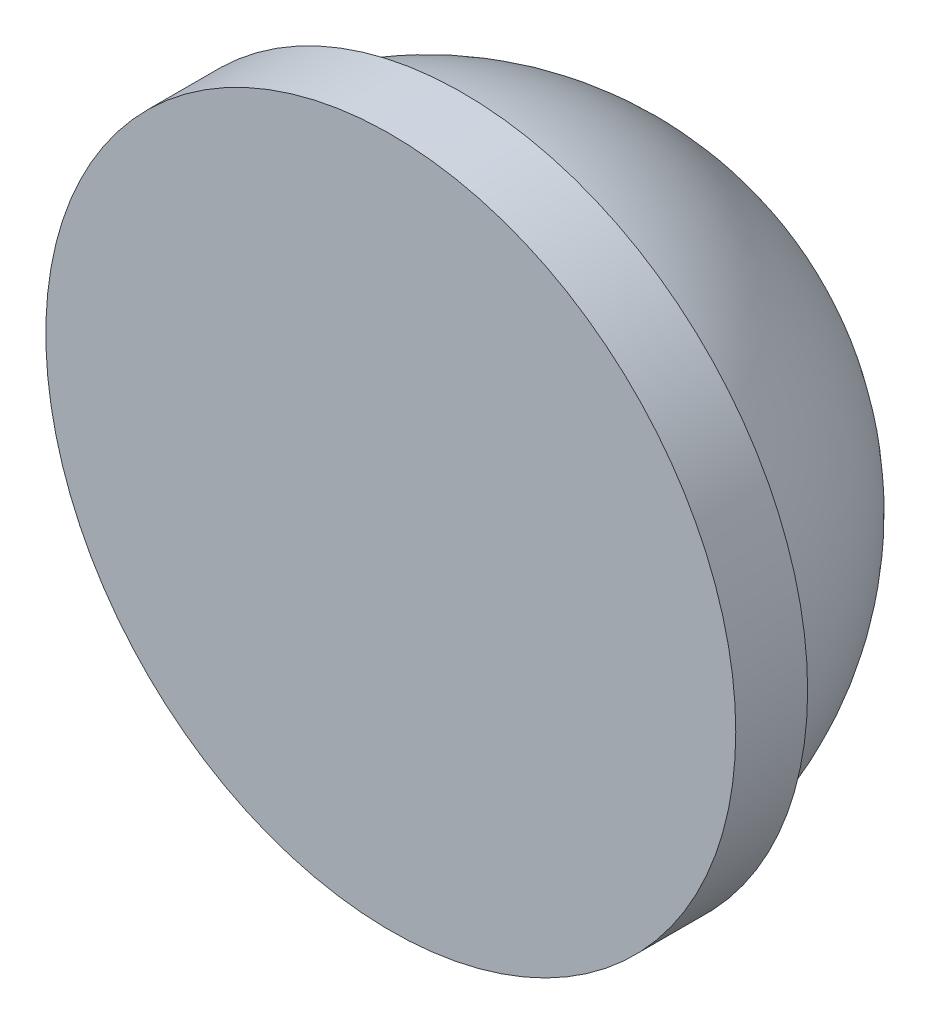
ISO-10303-21;
HEADER;
FILE_DESCRIPTION(('STEP AP214'),'2;1');
FILE_NAME('part.step','',(''),(''),'','','');
FILE_SCHEMA(('AUTOMOTIVE_DESIGN { 1 0 10303 214 1 1 1 1 }'));
ENDSEC;
DATA;
#1=APPLICATION_CONTEXT('core data for automotive mechanical design processes');
#2=APPLICATION_PROTOCOL_DEFINITION('international standard','automotive_design',2000,#1);
#3=PRODUCT_CONTEXT('',#1,'mechanical');
#4=PRODUCT('Part','Part','',(#3));
#5=PRODUCT_RELATED_PRODUCT_CATEGORY('part','',(#4));
#6=PRODUCT_DEFINITION_FORMATION('','',#4);
#7=PRODUCT_DEFINITION_CONTEXT('part definition',#1,'design');
#8=PRODUCT_DEFINITION('design','',#6,#7);
#9=PRODUCT_DEFINITION_SHAPE('','',#8);
#10=(LENGTH_UNIT() NAMED_UNIT(*) SI_UNIT(.MILLI.,.METRE.));
#11=(NAMED_UNIT(*) PLANE_ANGLE_UNIT() SI_UNIT($,.RADIAN.));
#12=(NAMED_UNIT(*) SI_UNIT($,.STERADIAN.) SOLID_ANGLE_UNIT());
#13=UNCERTAINTY_MEASURE_WITH_UNIT(LENGTH_MEASURE(1.E-05),#10,'distance_accuracy_value','');
#14=(GEOMETRIC_REPRESENTATION_CONTEXT(3) GLOBAL_UNCERTAINTY_ASSIGNED_CONTEXT((#13)) GLOBAL_UNIT_ASSIGNED_CONTEXT((#10,
#11,#12)) REPRESENTATION_CONTEXT('',''));
#15=CARTESIAN_POINT('',(0.,0.,0.));
#16=DIRECTION('',(0.,0.,1.));
#17=DIRECTION('',(1.,0.,0.));
#18=AXIS2_PLACEMENT_3D('',#15,#16,#17);
#19=CARTESIAN_POINT('',(0.,0.,0.5));
#20=DIRECTION('',(0.,0.,-1.));
#21=DIRECTION('',(-1.,0.,0.));
#22=AXIS2_PLACEMENT_3D('',#19,#20,#21);
#23=PLANE('',#22);
#24=CARTESIAN_POINT('',(0.,0.,0.5));
#25=DIRECTION('',(0.,0.,1.));
#26=DIRECTION('',(1.,0.,0.));
#27=AXIS2_PLACEMENT_3D('',#24,#25,#26);
#28=CIRCLE('',#27,4.8);
#29=CARTESIAN_POINT('',(4.8,0.,0.5));
#30=VERTEX_POINT('',#29);
#31=EDGE_CURVE('E41',#30,#30,#28,.T.);
#32=ORIENTED_EDGE('',*,*,#31,.T.);
#33=EDGE_LOOP('',(#32));
#34=FACE_BOUND('',#33,.T.);
#35=ADVANCED_FACE('F31',(#34),#23,.F.);
#36=CARTESIAN_POINT('',(0.,0.,0.));
#37=DIRECTION('',(0.,0.,1.));
#38=DIRECTION('',(0.,1.,0.));
#39=AXIS2_PLACEMENT_3D('',#36,#37,#38);
#40=SPHERICAL_SURFACE('',#39,4.5);
#41=CARTESIAN_POINT('',(0.,0.,-0.5));
#42=DIRECTION('',(0.,0.,1.));
#43=DIRECTION('',(1.,0.,0.));
#44=AXIS2_PLACEMENT_3D('',#41,#42,#43);
#45=CIRCLE('',#44,4.47213595499958);
#46=CARTESIAN_POINT('',(4.47213595499958,0.,-0.5));
#47=VERTEX_POINT('',#46);
#48=EDGE_CURVE('E10',#47,#47,#45,.T.);
#49=ORIENTED_EDGE('',*,*,#48,.F.);
#50=EDGE_LOOP('',(#49));
#51=FACE_BOUND('',#50,.T.);
#52=ADVANCED_FACE('F56',(#51),#40,.T.);
#53=CARTESIAN_POINT('',(0.,4.47213595499958,-0.5));
#54=DIRECTION('',(0.,0.,1.));
#55=DIRECTION('',(1.,0.,0.));
#56=AXIS2_PLACEMENT_3D('',#53,#54,#55);
#57=PLANE('',#56);
#58=CARTESIAN_POINT('',(0.,0.,-0.5));
#59=DIRECTION('',(0.,0.,1.));
#60=DIRECTION('',(1.,0.,0.));
#61=AXIS2_PLACEMENT_3D('',#58,#59,#60);
#62=CIRCLE('',#61,4.8);
#63=CARTESIAN_POINT('',(4.8,0.,-0.5));
#64=VERTEX_POINT('',#63);
#65=EDGE_CURVE('E37',#64,#64,#62,.T.);
#66=ORIENTED_EDGE('',*,*,#65,.F.);
#67=EDGE_LOOP('',(#66));
#68=FACE_BOUND('',#67,.T.);
#69=ORIENTED_EDGE('',*,*,#48,.T.);
#70=EDGE_LOOP('',(#69));
#71=FACE_BOUND('',#70,.T.);
#72=ADVANCED_FACE('F51',(#68,#71),#57,.F.);
#73=CARTESIAN_POINT('',(0.,0.,0.5));
#74=DIRECTION('',(0.,0.,1.));
#75=DIRECTION('',(1.,0.,0.));
#76=AXIS2_PLACEMENT_3D('',#73,#74,#75);
#77=CYLINDRICAL_SURFACE('',#76,4.8);
#78=ORIENTED_EDGE('',*,*,#31,.F.);
#79=EDGE_LOOP('',(#78));
#80=FACE_BOUND('',#79,.T.);
#81=ORIENTED_EDGE('',*,*,#65,.T.);
#82=EDGE_LOOP('',(#81));
#83=FACE_BOUND('',#82,.T.);
#84=ADVANCED_FACE('F49',(#80,#83),#77,.T.);
#85=CLOSED_SHELL('',(#35,#52,#72,#84));
#86=MANIFOLD_SOLID_BREP('B2',#85);
#87=ADVANCED_BREP_SHAPE_REPRESENTATION('',(#18,#86),#14);
#88=SHAPE_DEFINITION_REPRESENTATION(#9,#87);
ENDSEC;
END-ISO-10303-21;
